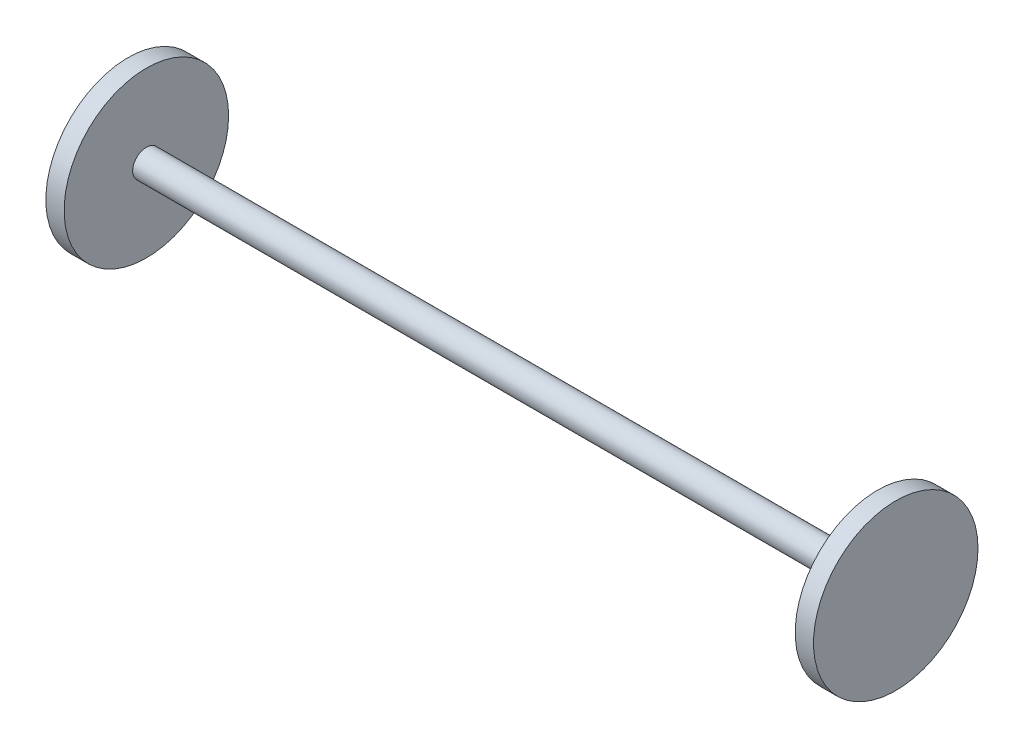
ISO-10303-21;
HEADER;
FILE_DESCRIPTION(('STEP AP214'),'2;1');
FILE_NAME('part.step','',(''),(''),'','','');
FILE_SCHEMA(('AUTOMOTIVE_DESIGN { 1 0 10303 214 1 1 1 1 }'));
ENDSEC;
DATA;
#1=APPLICATION_CONTEXT('core data for automotive mechanical design processes');
#2=APPLICATION_PROTOCOL_DEFINITION('international standard','automotive_design',2000,#1);
#3=PRODUCT_CONTEXT('',#1,'mechanical');
#4=PRODUCT('Part','Part','',(#3));
#5=PRODUCT_RELATED_PRODUCT_CATEGORY('part','',(#4));
#6=PRODUCT_DEFINITION_FORMATION('','',#4);
#7=PRODUCT_DEFINITION_CONTEXT('part definition',#1,'design');
#8=PRODUCT_DEFINITION('design','',#6,#7);
#9=PRODUCT_DEFINITION_SHAPE('','',#8);
#10=(LENGTH_UNIT() NAMED_UNIT(*) SI_UNIT(.MILLI.,.METRE.));
#11=(NAMED_UNIT(*) PLANE_ANGLE_UNIT() SI_UNIT($,.RADIAN.));
#12=(NAMED_UNIT(*) SI_UNIT($,.STERADIAN.) SOLID_ANGLE_UNIT());
#13=UNCERTAINTY_MEASURE_WITH_UNIT(LENGTH_MEASURE(1.E-05),#10,'distance_accuracy_value','');
#14=(GEOMETRIC_REPRESENTATION_CONTEXT(3) GLOBAL_UNCERTAINTY_ASSIGNED_CONTEXT((#13)) GLOBAL_UNIT_ASSIGNED_CONTEXT((#10,
#11,#12)) REPRESENTATION_CONTEXT('',''));
#15=CARTESIAN_POINT('',(0.,0.,0.));
#16=DIRECTION('',(0.,0.,1.));
#17=DIRECTION('',(1.,0.,0.));
#18=AXIS2_PLACEMENT_3D('',#15,#16,#17);
#19=CARTESIAN_POINT('',(200.,0.,0.));
#20=DIRECTION('',(-1.,0.,0.));
#21=DIRECTION('',(0.,0.,1.));
#22=AXIS2_PLACEMENT_3D('',#19,#20,#21);
#23=CYLINDRICAL_SURFACE('',#22,7.5);
#24=CARTESIAN_POINT('',(200.,0.,0.));
#25=DIRECTION('',(1.,0.,0.));
#26=DIRECTION('',(0.,0.,-1.));
#27=AXIS2_PLACEMENT_3D('',#24,#25,#26);
#28=CIRCLE('',#27,7.5);
#29=CARTESIAN_POINT('',(200.,0.,-7.5));
#30=VERTEX_POINT('',#29);
#31=EDGE_CURVE('E10',#30,#30,#28,.T.);
#32=ORIENTED_EDGE('',*,*,#31,.F.);
#33=EDGE_LOOP('',(#32));
#34=FACE_BOUND('',#33,.T.);
#35=CARTESIAN_POINT('',(-200.,0.,0.));
#36=DIRECTION('',(1.,0.,0.));
#37=DIRECTION('',(0.,0.,-1.));
#38=AXIS2_PLACEMENT_3D('',#35,#36,#37);
#39=CIRCLE('',#38,7.5);
#40=CARTESIAN_POINT('',(-200.,0.,-7.5));
#41=VERTEX_POINT('',#40);
#42=EDGE_CURVE('E44',#41,#41,#39,.T.);
#43=ORIENTED_EDGE('',*,*,#42,.T.);
#44=EDGE_LOOP('',(#43));
#45=FACE_BOUND('',#44,.T.);
#46=ADVANCED_FACE('F41',(#34,#45),#23,.T.);
#47=CARTESIAN_POINT('',(210.,0.,0.));
#48=DIRECTION('',(-1.,0.,0.));
#49=DIRECTION('',(0.,0.,1.));
#50=AXIS2_PLACEMENT_3D('',#47,#48,#49);
#51=CYLINDRICAL_SURFACE('',#50,45.);
#52=CARTESIAN_POINT('',(210.,0.,0.));
#53=DIRECTION('',(1.,0.,0.));
#54=DIRECTION('',(0.,0.,-1.));
#55=AXIS2_PLACEMENT_3D('',#52,#53,#54);
#56=CIRCLE('',#55,45.);
#57=CARTESIAN_POINT('',(210.,0.,-45.));
#58=VERTEX_POINT('',#57);
#59=EDGE_CURVE('E49',#58,#58,#56,.T.);
#60=ORIENTED_EDGE('',*,*,#59,.F.);
#61=EDGE_LOOP('',(#60));
#62=FACE_BOUND('',#61,.T.);
#63=CARTESIAN_POINT('',(200.,0.,0.));
#64=DIRECTION('',(1.,0.,0.));
#65=DIRECTION('',(0.,0.,-1.));
#66=AXIS2_PLACEMENT_3D('',#63,#64,#65);
#67=CIRCLE('',#66,45.);
#68=CARTESIAN_POINT('',(200.,0.,-45.));
#69=VERTEX_POINT('',#68);
#70=EDGE_CURVE('E54',#69,#69,#67,.T.);
#71=ORIENTED_EDGE('',*,*,#70,.T.);
#72=EDGE_LOOP('',(#71));
#73=FACE_BOUND('',#72,.T.);
#74=ADVANCED_FACE('F95',(#62,#73),#51,.T.);
#75=CARTESIAN_POINT('',(210.,0.,0.));
#76=DIRECTION('',(1.,0.,0.));
#77=DIRECTION('',(0.,0.,-1.));
#78=AXIS2_PLACEMENT_3D('',#75,#76,#77);
#79=PLANE('',#78);
#80=ORIENTED_EDGE('',*,*,#59,.T.);
#81=EDGE_LOOP('',(#80));
#82=FACE_BOUND('',#81,.T.);
#83=ADVANCED_FACE('F91',(#82),#79,.T.);
#84=CARTESIAN_POINT('',(200.,0.,0.));
#85=DIRECTION('',(1.,0.,0.));
#86=DIRECTION('',(0.,0.,-1.));
#87=AXIS2_PLACEMENT_3D('',#84,#85,#86);
#88=PLANE('',#87);
#89=ORIENTED_EDGE('',*,*,#31,.T.);
#90=EDGE_LOOP('',(#89));
#91=FACE_BOUND('',#90,.T.);
#92=ORIENTED_EDGE('',*,*,#70,.F.);
#93=EDGE_LOOP('',(#92));
#94=FACE_BOUND('',#93,.T.);
#95=ADVANCED_FACE('F83',(#91,#94),#88,.F.);
#96=CARTESIAN_POINT('',(-210.,0.,0.));
#97=DIRECTION('',(1.,0.,0.));
#98=DIRECTION('',(0.,0.,-1.));
#99=AXIS2_PLACEMENT_3D('',#96,#97,#98);
#100=CYLINDRICAL_SURFACE('',#99,45.);
#101=CARTESIAN_POINT('',(-210.,0.,0.));
#102=DIRECTION('',(1.,0.,0.));
#103=DIRECTION('',(0.,0.,-1.));
#104=AXIS2_PLACEMENT_3D('',#101,#102,#103);
#105=CIRCLE('',#104,45.);
#106=CARTESIAN_POINT('',(-210.,0.,-45.));
#107=VERTEX_POINT('',#106);
#108=EDGE_CURVE('E64',#107,#107,#105,.T.);
#109=ORIENTED_EDGE('',*,*,#108,.T.);
#110=EDGE_LOOP('',(#109));
#111=FACE_BOUND('',#110,.T.);
#112=CARTESIAN_POINT('',(-200.,0.,0.));
#113=DIRECTION('',(1.,0.,0.));
#114=DIRECTION('',(0.,0.,-1.));
#115=AXIS2_PLACEMENT_3D('',#112,#113,#114);
#116=CIRCLE('',#115,45.);
#117=CARTESIAN_POINT('',(-200.,0.,-45.));
#118=VERTEX_POINT('',#117);
#119=EDGE_CURVE('E60',#118,#118,#116,.T.);
#120=ORIENTED_EDGE('',*,*,#119,.F.);
#121=EDGE_LOOP('',(#120));
#122=FACE_BOUND('',#121,.T.);
#123=ADVANCED_FACE('F81',(#111,#122),#100,.T.);
#124=CARTESIAN_POINT('',(-210.,0.,0.));
#125=DIRECTION('',(-1.,0.,0.));
#126=DIRECTION('',(0.,0.,-1.));
#127=AXIS2_PLACEMENT_3D('',#124,#125,#126);
#128=PLANE('',#127);
#129=ORIENTED_EDGE('',*,*,#108,.F.);
#130=EDGE_LOOP('',(#129));
#131=FACE_BOUND('',#130,.T.);
#132=ADVANCED_FACE('F77',(#131),#128,.T.);
#133=CARTESIAN_POINT('',(-200.,0.,0.));
#134=DIRECTION('',(-1.,0.,0.));
#135=DIRECTION('',(0.,0.,-1.));
#136=AXIS2_PLACEMENT_3D('',#133,#134,#135);
#137=PLANE('',#136);
#138=ORIENTED_EDGE('',*,*,#42,.F.);
#139=EDGE_LOOP('',(#138));
#140=FACE_BOUND('',#139,.T.);
#141=ORIENTED_EDGE('',*,*,#119,.T.);
#142=EDGE_LOOP('',(#141));
#143=FACE_BOUND('',#142,.T.);
#144=ADVANCED_FACE('F74',(#140,#143),#137,.F.);
#145=CLOSED_SHELL('',(#46,#74,#83,#95,#123,#132,#144));
#146=MANIFOLD_SOLID_BREP('B2',#145);
#147=ADVANCED_BREP_SHAPE_REPRESENTATION('',(#18,#146),#14);
#148=SHAPE_DEFINITION_REPRESENTATION(#9,#147);
ENDSEC;
END-ISO-10303-21;
